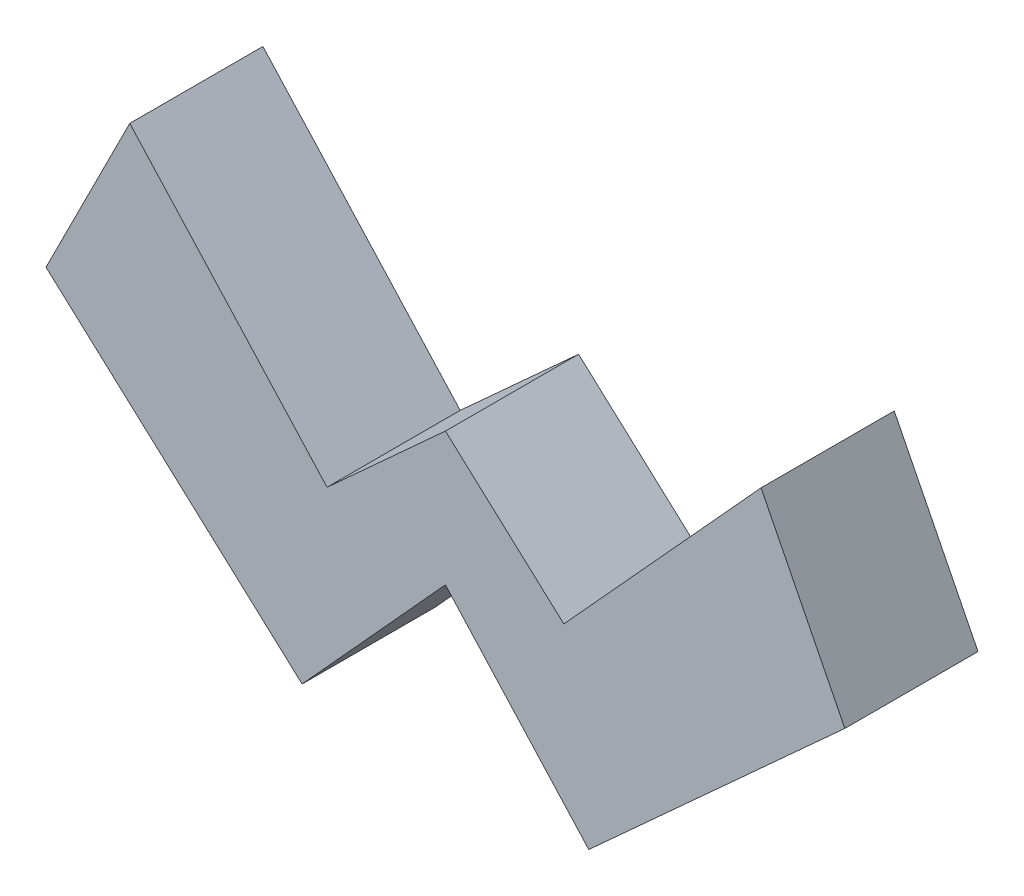
ISO-10303-21;
HEADER;
FILE_DESCRIPTION(('STEP AP214'),'2;1');
FILE_NAME('part.step','',(''),(''),'','','');
FILE_SCHEMA(('AUTOMOTIVE_DESIGN { 1 0 10303 214 1 1 1 1 }'));
ENDSEC;
DATA;
#1=APPLICATION_CONTEXT('core data for automotive mechanical design processes');
#2=APPLICATION_PROTOCOL_DEFINITION('international standard','automotive_design',2000,#1);
#3=PRODUCT_CONTEXT('',#1,'mechanical');
#4=PRODUCT('Part','Part','',(#3));
#5=PRODUCT_RELATED_PRODUCT_CATEGORY('part','',(#4));
#6=PRODUCT_DEFINITION_FORMATION('','',#4);
#7=PRODUCT_DEFINITION_CONTEXT('part definition',#1,'design');
#8=PRODUCT_DEFINITION('design','',#6,#7);
#9=PRODUCT_DEFINITION_SHAPE('','',#8);
#10=(LENGTH_UNIT() NAMED_UNIT(*) SI_UNIT(.MILLI.,.METRE.));
#11=(NAMED_UNIT(*) PLANE_ANGLE_UNIT() SI_UNIT($,.RADIAN.));
#12=(NAMED_UNIT(*) SI_UNIT($,.STERADIAN.) SOLID_ANGLE_UNIT());
#13=UNCERTAINTY_MEASURE_WITH_UNIT(LENGTH_MEASURE(1.E-05),#10,'distance_accuracy_value','');
#14=(GEOMETRIC_REPRESENTATION_CONTEXT(3) GLOBAL_UNCERTAINTY_ASSIGNED_CONTEXT((#13)) GLOBAL_UNIT_ASSIGNED_CONTEXT((#10,
#11,#12)) REPRESENTATION_CONTEXT('',''));
#15=CARTESIAN_POINT('',(0.,0.,0.));
#16=DIRECTION('',(0.,0.,1.));
#17=DIRECTION('',(1.,0.,0.));
#18=AXIS2_PLACEMENT_3D('',#15,#16,#17);
#19=CARTESIAN_POINT('',(2.48915588765552,2.73260044486168,5.));
#20=DIRECTION('',(0.673409170584767,0.739269970289837,0.));
#21=DIRECTION('',(-0.739269970289837,0.673409170584767,0.));
#22=AXIS2_PLACEMENT_3D('',#19,#20,#21);
#23=PLANE('',#22);
#24=DIRECTION('',(0.739269970289837,-0.673409170584767,0.));
#25=VECTOR('',#24,1.);
#26=CARTESIAN_POINT('',(2.48915588765552,2.73260044486168,0.));
#27=LINE('',#26,#25);
#28=CARTESIAN_POINT('',(0.,5.,0.));
#29=VERTEX_POINT('',#28);
#30=CARTESIAN_POINT('',(4.44647334959664,0.949658378244143,0.));
#31=VERTEX_POINT('',#30);
#32=EDGE_CURVE('E139',#29,#31,#27,.T.);
#33=ORIENTED_EDGE('',*,*,#32,.F.);
#34=DIRECTION('',(0.,0.,-1.));
#35=VECTOR('',#34,1.);
#36=CARTESIAN_POINT('',(0.,5.,5.));
#37=LINE('',#36,#35);
#38=CARTESIAN_POINT('',(0.,5.,5.));
#39=VERTEX_POINT('',#38);
#40=EDGE_CURVE('E11',#39,#29,#37,.T.);
#41=ORIENTED_EDGE('',*,*,#40,.F.);
#42=DIRECTION('',(0.739269970289837,-0.673409170584767,0.));
#43=VECTOR('',#42,1.);
#44=CARTESIAN_POINT('',(2.48915588765552,2.73260044486168,5.));
#45=LINE('',#44,#43);
#46=CARTESIAN_POINT('',(4.44647334959664,0.949658378244143,5.));
#47=VERTEX_POINT('',#46);
#48=EDGE_CURVE('E161',#39,#47,#45,.T.);
#49=ORIENTED_EDGE('',*,*,#48,.T.);
#50=DIRECTION('',(0.,0.,-1.));
#51=VECTOR('',#50,1.);
#52=CARTESIAN_POINT('',(4.44647334959664,0.949658378244143,5.));
#53=LINE('',#52,#51);
#54=EDGE_CURVE('E50',#47,#31,#53,.T.);
#55=ORIENTED_EDGE('',*,*,#54,.T.);
#56=EDGE_LOOP('',(#33,#41,#49,#55));
#57=FACE_BOUND('',#56,.T.);
#58=ADVANCED_FACE('F34',(#57),#23,.T.);
#59=CARTESIAN_POINT('',(-2.48915588765552,2.73260044486168,5.));
#60=DIRECTION('',(0.673409170584767,-0.739269970289837,0.));
#61=DIRECTION('',(0.739269970289837,0.673409170584767,0.));
#62=AXIS2_PLACEMENT_3D('',#59,#60,#61);
#63=PLANE('',#62);
#64=DIRECTION('',(-0.739269970289837,-0.673409170584767,0.));
#65=VECTOR('',#64,1.);
#66=CARTESIAN_POINT('',(-2.48915588765552,2.73260044486168,0.));
#67=LINE('',#66,#65);
#68=CARTESIAN_POINT('',(-4.44647334959664,0.949658378244143,0.));
#69=VERTEX_POINT('',#68);
#70=EDGE_CURVE('E141',#29,#69,#67,.T.);
#71=ORIENTED_EDGE('',*,*,#70,.T.);
#72=DIRECTION('',(0.,0.,-1.));
#73=VECTOR('',#72,1.);
#74=CARTESIAN_POINT('',(-4.44647334959664,0.949658378244143,5.));
#75=LINE('',#74,#73);
#76=CARTESIAN_POINT('',(-4.44647334959664,0.949658378244143,5.));
#77=VERTEX_POINT('',#76);
#78=EDGE_CURVE('E42',#77,#69,#75,.T.);
#79=ORIENTED_EDGE('',*,*,#78,.F.);
#80=DIRECTION('',(-0.739269970289837,-0.673409170584767,0.));
#81=VECTOR('',#80,1.);
#82=CARTESIAN_POINT('',(-2.48915588765552,2.73260044486168,5.));
#83=LINE('',#82,#81);
#84=EDGE_CURVE('E314',#39,#77,#83,.T.);
#85=ORIENTED_EDGE('',*,*,#84,.F.);
#86=ORIENTED_EDGE('',*,*,#40,.T.);
#87=EDGE_LOOP('',(#71,#79,#85,#86));
#88=FACE_BOUND('',#87,.T.);
#89=ADVANCED_FACE('F221',(#88),#63,.F.);
#90=CARTESIAN_POINT('',(-1.95731746194113,-1.78294206661754,5.));
#91=DIRECTION('',(-0.739269970289839,-0.673409170584764,0.));
#92=DIRECTION('',(0.673409170584764,-0.739269970289839,0.));
#93=AXIS2_PLACEMENT_3D('',#90,#91,#92);
#94=PLANE('',#93);
#95=DIRECTION('',(-0.673409170584764,0.739269970289839,0.));
#96=VECTOR('',#95,1.);
#97=CARTESIAN_POINT('',(-1.95731746194113,-1.78294206661754,0.));
#98=LINE('',#97,#96);
#99=CARTESIAN_POINT('',(-11.853974226029,9.08162805143237,0.));
#100=VERTEX_POINT('',#99);
#101=EDGE_CURVE('E143',#69,#100,#98,.T.);
#102=ORIENTED_EDGE('',*,*,#101,.T.);
#103=DIRECTION('',(0.,0.,-1.));
#104=VECTOR('',#103,1.);
#105=CARTESIAN_POINT('',(-11.853974226029,9.08162805143237,5.));
#106=LINE('',#105,#104);
#107=CARTESIAN_POINT('',(-11.853974226029,9.08162805143237,5.));
#108=VERTEX_POINT('',#107);
#109=EDGE_CURVE('E173',#108,#100,#106,.T.);
#110=ORIENTED_EDGE('',*,*,#109,.F.);
#111=DIRECTION('',(-0.673409170584764,0.739269970289839,0.));
#112=VECTOR('',#111,1.);
#113=CARTESIAN_POINT('',(-1.95731746194113,-1.78294206661754,5.));
#114=LINE('',#113,#112);
#115=EDGE_CURVE('E182',#77,#108,#114,.T.);
#116=ORIENTED_EDGE('',*,*,#115,.F.);
#117=ORIENTED_EDGE('',*,*,#78,.T.);
#118=EDGE_LOOP('',(#102,#110,#116,#117));
#119=FACE_BOUND('',#118,.T.);
#120=ADVANCED_FACE('F180',(#119),#94,.F.);
#121=CARTESIAN_POINT('',(-13.1057288617854,6.5935768367675,5.));
#122=DIRECTION('',(0.893314418098043,-0.449432253424422,0.));
#123=DIRECTION('',(0.449432253424422,0.893314418098043,0.));
#124=AXIS2_PLACEMENT_3D('',#121,#122,#123);
#125=PLANE('',#124);
#126=DIRECTION('',(-0.449432253424422,-0.893314418098044,0.));
#127=VECTOR('',#126,1.);
#128=CARTESIAN_POINT('',(-13.1057288617854,6.5935768367675,0.));
#129=LINE('',#128,#127);
#130=CARTESIAN_POINT('',(-15.,2.82842712474607,0.));
#131=VERTEX_POINT('',#130);
#132=EDGE_CURVE('E145',#100,#131,#129,.T.);
#133=ORIENTED_EDGE('',*,*,#132,.T.);
#134=DIRECTION('',(0.,0.,-1.));
#135=VECTOR('',#134,1.);
#136=CARTESIAN_POINT('',(-15.,2.82842712474607,5.));
#137=LINE('',#136,#135);
#138=CARTESIAN_POINT('',(-15.,2.82842712474607,5.));
#139=VERTEX_POINT('',#138);
#140=EDGE_CURVE('E170',#139,#131,#137,.T.);
#141=ORIENTED_EDGE('',*,*,#140,.F.);
#142=DIRECTION('',(-0.449432253424422,-0.893314418098044,0.));
#143=VECTOR('',#142,1.);
#144=CARTESIAN_POINT('',(-13.1057288617854,6.5935768367675,5.));
#145=LINE('',#144,#143);
#146=EDGE_CURVE('E201',#108,#139,#145,.T.);
#147=ORIENTED_EDGE('',*,*,#146,.F.);
#148=ORIENTED_EDGE('',*,*,#109,.T.);
#149=EDGE_LOOP('',(#133,#141,#147,#148));
#150=FACE_BOUND('',#149,.T.);
#151=ADVANCED_FACE('F192',(#150),#125,.F.);
#152=CARTESIAN_POINT('',(-5.38264558357766,-5.91837194856761,5.));
#153=DIRECTION('',(0.672830697947207,0.739796493570951,0.));
#154=DIRECTION('',(-0.739796493570951,0.672830697947207,0.));
#155=AXIS2_PLACEMENT_3D('',#152,#153,#154);
#156=PLANE('',#155);
#157=DIRECTION('',(0.739796493570951,-0.672830697947207,0.));
#158=VECTOR('',#157,1.);
#159=CARTESIAN_POINT('',(-5.38264558357766,-5.91837194856761,0.));
#160=LINE('',#159,#158);
#161=CARTESIAN_POINT('',(-5.38264558357764,-5.91837194856763,0.));
#162=VERTEX_POINT('',#161);
#163=EDGE_CURVE('E147',#131,#162,#160,.T.);
#164=ORIENTED_EDGE('',*,*,#163,.T.);
#165=DIRECTION('',(0.,0.,-1.));
#166=VECTOR('',#165,1.);
#167=CARTESIAN_POINT('',(-5.38264558357764,-5.91837194856763,5.));
#168=LINE('',#167,#166);
#169=CARTESIAN_POINT('',(-5.38264558357764,-5.91837194856763,5.));
#170=VERTEX_POINT('',#169);
#171=EDGE_CURVE('E167',#170,#162,#168,.T.);
#172=ORIENTED_EDGE('',*,*,#171,.F.);
#173=DIRECTION('',(0.739796493570951,-0.672830697947207,0.));
#174=VECTOR('',#173,1.);
#175=CARTESIAN_POINT('',(-5.38264558357766,-5.91837194856761,5.));
#176=LINE('',#175,#174);
#177=EDGE_CURVE('E198',#139,#170,#176,.T.);
#178=ORIENTED_EDGE('',*,*,#177,.F.);
#179=ORIENTED_EDGE('',*,*,#140,.T.);
#180=EDGE_LOOP('',(#164,#172,#178,#179));
#181=FACE_BOUND('',#180,.T.);
#182=ADVANCED_FACE('F196',(#181),#156,.F.);
#183=CARTESIAN_POINT('',(0.,0.,5.));
#184=DIRECTION('',(-0.739796493570953,0.672830697947205,0.));
#185=DIRECTION('',(-0.672830697947205,-0.739796493570953,0.));
#186=AXIS2_PLACEMENT_3D('',#183,#184,#185);
#187=PLANE('',#186);
#188=DIRECTION('',(0.672830697947205,0.739796493570953,0.));
#189=VECTOR('',#188,1.);
#190=CARTESIAN_POINT('',(0.,0.,0.));
#191=LINE('',#190,#189);
#192=CARTESIAN_POINT('',(0.,0.,0.));
#193=VERTEX_POINT('',#192);
#194=EDGE_CURVE('E149',#162,#193,#191,.T.);
#195=ORIENTED_EDGE('',*,*,#194,.T.);
#196=DIRECTION('',(0.,0.,-1.));
#197=VECTOR('',#196,1.);
#198=CARTESIAN_POINT('',(0.,0.,5.));
#199=LINE('',#198,#197);
#200=CARTESIAN_POINT('',(0.,0.,5.));
#201=VERTEX_POINT('',#200);
#202=EDGE_CURVE('E165',#201,#193,#199,.T.);
#203=ORIENTED_EDGE('',*,*,#202,.F.);
#204=DIRECTION('',(0.672830697947205,0.739796493570953,0.));
#205=VECTOR('',#204,1.);
#206=CARTESIAN_POINT('',(0.,0.,5.));
#207=LINE('',#206,#205);
#208=EDGE_CURVE('E200',#170,#201,#207,.T.);
#209=ORIENTED_EDGE('',*,*,#208,.F.);
#210=ORIENTED_EDGE('',*,*,#171,.T.);
#211=EDGE_LOOP('',(#195,#203,#209,#210));
#212=FACE_BOUND('',#211,.T.);
#213=ADVANCED_FACE('F234',(#212),#187,.F.);
#214=CARTESIAN_POINT('',(0.,0.,5.));
#215=DIRECTION('',(-0.739796493570953,-0.672830697947205,0.));
#216=DIRECTION('',(0.672830697947205,-0.739796493570953,0.));
#217=AXIS2_PLACEMENT_3D('',#214,#215,#216);
#218=PLANE('',#217);
#219=DIRECTION('',(-0.672830697947205,0.739796493570953,0.));
#220=VECTOR('',#219,1.);
#221=CARTESIAN_POINT('',(0.,0.,0.));
#222=LINE('',#221,#220);
#223=CARTESIAN_POINT('',(5.38264558357764,-5.91837194856763,0.));
#224=VERTEX_POINT('',#223);
#225=EDGE_CURVE('E152',#224,#193,#222,.T.);
#226=ORIENTED_EDGE('',*,*,#225,.F.);
#227=DIRECTION('',(0.,0.,-1.));
#228=VECTOR('',#227,1.);
#229=CARTESIAN_POINT('',(5.38264558357764,-5.91837194856763,5.));
#230=LINE('',#229,#228);
#231=CARTESIAN_POINT('',(5.38264558357764,-5.91837194856763,5.));
#232=VERTEX_POINT('',#231);
#233=EDGE_CURVE('E121',#232,#224,#230,.T.);
#234=ORIENTED_EDGE('',*,*,#233,.F.);
#235=DIRECTION('',(-0.672830697947205,0.739796493570953,0.));
#236=VECTOR('',#235,1.);
#237=CARTESIAN_POINT('',(0.,0.,5.));
#238=LINE('',#237,#236);
#239=EDGE_CURVE('E131',#232,#201,#238,.T.);
#240=ORIENTED_EDGE('',*,*,#239,.T.);
#241=ORIENTED_EDGE('',*,*,#202,.T.);
#242=EDGE_LOOP('',(#226,#234,#240,#241));
#243=FACE_BOUND('',#242,.T.);
#244=ADVANCED_FACE('F208',(#243),#218,.T.);
#245=CARTESIAN_POINT('',(5.38264558357766,-5.91837194856761,5.));
#246=DIRECTION('',(0.672830697947207,-0.739796493570951,0.));
#247=DIRECTION('',(0.739796493570951,0.672830697947207,0.));
#248=AXIS2_PLACEMENT_3D('',#245,#246,#247);
#249=PLANE('',#248);
#250=DIRECTION('',(-0.739796493570951,-0.672830697947207,0.));
#251=VECTOR('',#250,1.);
#252=CARTESIAN_POINT('',(5.38264558357766,-5.91837194856761,0.));
#253=LINE('',#252,#251);
#254=CARTESIAN_POINT('',(15.,2.82842712474607,0.));
#255=VERTEX_POINT('',#254);
#256=EDGE_CURVE('E117',#255,#224,#253,.T.);
#257=ORIENTED_EDGE('',*,*,#256,.F.);
#258=DIRECTION('',(0.,0.,-1.));
#259=VECTOR('',#258,1.);
#260=CARTESIAN_POINT('',(15.,2.82842712474607,5.));
#261=LINE('',#260,#259);
#262=CARTESIAN_POINT('',(15.,2.82842712474607,5.));
#263=VERTEX_POINT('',#262);
#264=EDGE_CURVE('E112',#263,#255,#261,.T.);
#265=ORIENTED_EDGE('',*,*,#264,.F.);
#266=DIRECTION('',(-0.739796493570951,-0.672830697947207,0.));
#267=VECTOR('',#266,1.);
#268=CARTESIAN_POINT('',(5.38264558357766,-5.91837194856761,5.));
#269=LINE('',#268,#267);
#270=EDGE_CURVE('E115',#263,#232,#269,.T.);
#271=ORIENTED_EDGE('',*,*,#270,.T.);
#272=ORIENTED_EDGE('',*,*,#233,.T.);
#273=EDGE_LOOP('',(#257,#265,#271,#272));
#274=FACE_BOUND('',#273,.T.);
#275=ADVANCED_FACE('F114',(#274),#249,.T.);
#276=CARTESIAN_POINT('',(13.1057288617854,6.5935768367675,5.));
#277=DIRECTION('',(0.893314418098043,0.449432253424422,0.));
#278=DIRECTION('',(-0.449432253424422,0.893314418098043,0.));
#279=AXIS2_PLACEMENT_3D('',#276,#277,#278);
#280=PLANE('',#279);
#281=DIRECTION('',(0.449432253424422,-0.893314418098044,0.));
#282=VECTOR('',#281,1.);
#283=CARTESIAN_POINT('',(13.1057288617854,6.5935768367675,0.));
#284=LINE('',#283,#282);
#285=CARTESIAN_POINT('',(11.853974226029,9.08162805143237,0.));
#286=VERTEX_POINT('',#285);
#287=EDGE_CURVE('E156',#286,#255,#284,.T.);
#288=ORIENTED_EDGE('',*,*,#287,.F.);
#289=DIRECTION('',(0.,0.,-1.));
#290=VECTOR('',#289,1.);
#291=CARTESIAN_POINT('',(11.853974226029,9.08162805143237,5.));
#292=LINE('',#291,#290);
#293=CARTESIAN_POINT('',(11.853974226029,9.08162805143237,5.));
#294=VERTEX_POINT('',#293);
#295=EDGE_CURVE('E81',#294,#286,#292,.T.);
#296=ORIENTED_EDGE('',*,*,#295,.F.);
#297=DIRECTION('',(0.449432253424422,-0.893314418098044,0.));
#298=VECTOR('',#297,1.);
#299=CARTESIAN_POINT('',(13.1057288617854,6.5935768367675,5.));
#300=LINE('',#299,#298);
#301=EDGE_CURVE('E129',#294,#263,#300,.T.);
#302=ORIENTED_EDGE('',*,*,#301,.T.);
#303=ORIENTED_EDGE('',*,*,#264,.T.);
#304=EDGE_LOOP('',(#288,#296,#302,#303));
#305=FACE_BOUND('',#304,.T.);
#306=ADVANCED_FACE('F133',(#305),#280,.T.);
#307=CARTESIAN_POINT('',(1.95731746194113,-1.78294206661754,5.));
#308=DIRECTION('',(-0.739269970289839,0.673409170584764,0.));
#309=DIRECTION('',(-0.673409170584764,-0.739269970289839,0.));
#310=AXIS2_PLACEMENT_3D('',#307,#308,#309);
#311=PLANE('',#310);
#312=DIRECTION('',(0.673409170584764,0.739269970289839,0.));
#313=VECTOR('',#312,1.);
#314=CARTESIAN_POINT('',(1.95731746194113,-1.78294206661754,0.));
#315=LINE('',#314,#313);
#316=EDGE_CURVE('E158',#31,#286,#315,.T.);
#317=ORIENTED_EDGE('',*,*,#316,.F.);
#318=ORIENTED_EDGE('',*,*,#54,.F.);
#319=DIRECTION('',(0.673409170584764,0.739269970289839,0.));
#320=VECTOR('',#319,1.);
#321=CARTESIAN_POINT('',(1.95731746194113,-1.78294206661754,5.));
#322=LINE('',#321,#320);
#323=EDGE_CURVE('E134',#47,#294,#322,.T.);
#324=ORIENTED_EDGE('',*,*,#323,.T.);
#325=ORIENTED_EDGE('',*,*,#295,.T.);
#326=EDGE_LOOP('',(#317,#318,#324,#325));
#327=FACE_BOUND('',#326,.T.);
#328=ADVANCED_FACE('F210',(#327),#311,.T.);
#329=CARTESIAN_POINT('',(0.,0.,5.));
#330=DIRECTION('',(0.,0.,1.));
#331=DIRECTION('',(1.,0.,0.));
#332=AXIS2_PLACEMENT_3D('',#329,#330,#331);
#333=PLANE('',#332);
#334=ORIENTED_EDGE('',*,*,#48,.F.);
#335=ORIENTED_EDGE('',*,*,#84,.T.);
#336=ORIENTED_EDGE('',*,*,#115,.T.);
#337=ORIENTED_EDGE('',*,*,#146,.T.);
#338=ORIENTED_EDGE('',*,*,#177,.T.);
#339=ORIENTED_EDGE('',*,*,#208,.T.);
#340=ORIENTED_EDGE('',*,*,#239,.F.);
#341=ORIENTED_EDGE('',*,*,#270,.F.);
#342=ORIENTED_EDGE('',*,*,#301,.F.);
#343=ORIENTED_EDGE('',*,*,#323,.F.);
#344=EDGE_LOOP('',(#334,#335,#336,#337,#338,#339,#340,#341,#342,#343));
#345=FACE_BOUND('',#344,.T.);
#346=ADVANCED_FACE('F127',(#345),#333,.T.);
#347=CARTESIAN_POINT('',(0.,0.,0.));
#348=DIRECTION('',(0.,0.,1.));
#349=DIRECTION('',(1.,0.,0.));
#350=AXIS2_PLACEMENT_3D('',#347,#348,#349);
#351=PLANE('',#350);
#352=ORIENTED_EDGE('',*,*,#32,.T.);
#353=ORIENTED_EDGE('',*,*,#316,.T.);
#354=ORIENTED_EDGE('',*,*,#287,.T.);
#355=ORIENTED_EDGE('',*,*,#256,.T.);
#356=ORIENTED_EDGE('',*,*,#225,.T.);
#357=ORIENTED_EDGE('',*,*,#194,.F.);
#358=ORIENTED_EDGE('',*,*,#163,.F.);
#359=ORIENTED_EDGE('',*,*,#132,.F.);
#360=ORIENTED_EDGE('',*,*,#101,.F.);
#361=ORIENTED_EDGE('',*,*,#70,.F.);
#362=EDGE_LOOP('',(#352,#353,#354,#355,#356,#357,#358,#359,#360,#361));
#363=FACE_BOUND('',#362,.T.);
#364=ADVANCED_FACE('F187',(#363),#351,.F.);
#365=CLOSED_SHELL('',(#58,#89,#120,#151,#182,#213,#244,#275,#306,#328,#346,#364));
#366=MANIFOLD_SOLID_BREP('B2',#365);
#367=ADVANCED_BREP_SHAPE_REPRESENTATION('',(#18,#366),#14);
#368=SHAPE_DEFINITION_REPRESENTATION(#9,#367);
ENDSEC;
END-ISO-10303-21;
